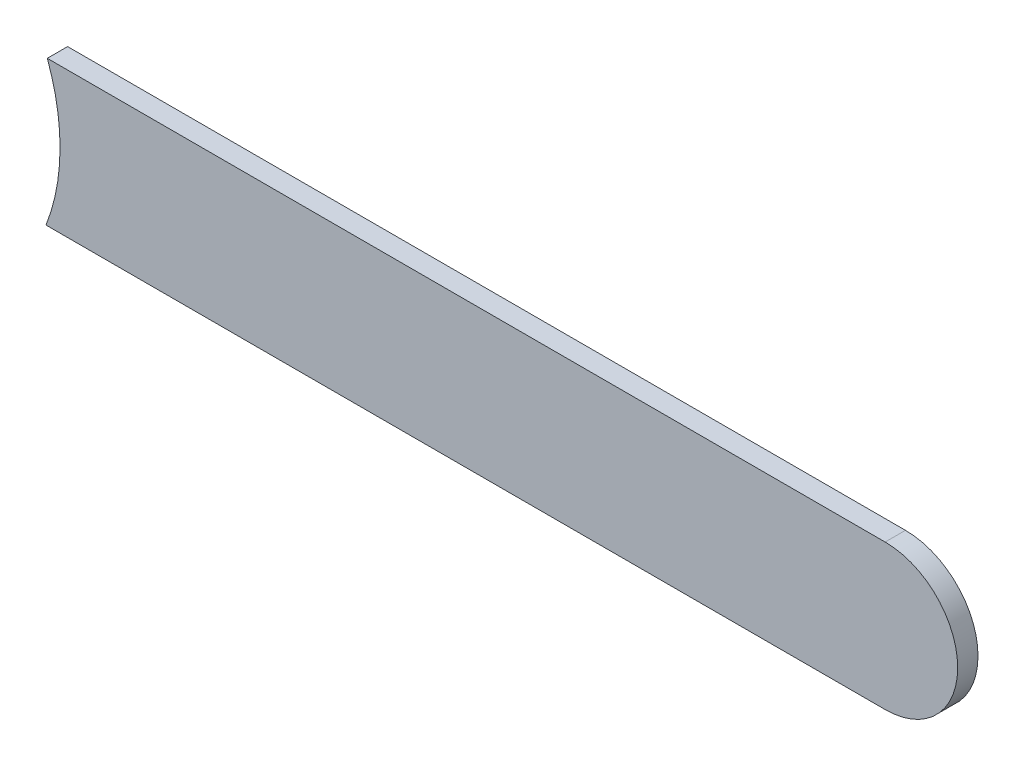
ISO-10303-21;
HEADER;
FILE_DESCRIPTION(('STEP AP214'),'2;1');
FILE_NAME('part.step','',(''),(''),'','','');
FILE_SCHEMA(('AUTOMOTIVE_DESIGN { 1 0 10303 214 1 1 1 1 }'));
ENDSEC;
DATA;
#1=APPLICATION_CONTEXT('core data for automotive mechanical design processes');
#2=APPLICATION_PROTOCOL_DEFINITION('international standard','automotive_design',2000,#1);
#3=PRODUCT_CONTEXT('',#1,'mechanical');
#4=PRODUCT('Part','Part','',(#3));
#5=PRODUCT_RELATED_PRODUCT_CATEGORY('part','',(#4));
#6=PRODUCT_DEFINITION_FORMATION('','',#4);
#7=PRODUCT_DEFINITION_CONTEXT('part definition',#1,'design');
#8=PRODUCT_DEFINITION('design','',#6,#7);
#9=PRODUCT_DEFINITION_SHAPE('','',#8);
#10=(LENGTH_UNIT() NAMED_UNIT(*) SI_UNIT(.MILLI.,.METRE.));
#11=(NAMED_UNIT(*) PLANE_ANGLE_UNIT() SI_UNIT($,.RADIAN.));
#12=(NAMED_UNIT(*) SI_UNIT($,.STERADIAN.) SOLID_ANGLE_UNIT());
#13=UNCERTAINTY_MEASURE_WITH_UNIT(LENGTH_MEASURE(1.E-05),#10,'distance_accuracy_value','');
#14=(GEOMETRIC_REPRESENTATION_CONTEXT(3) GLOBAL_UNCERTAINTY_ASSIGNED_CONTEXT((#13)) GLOBAL_UNIT_ASSIGNED_CONTEXT((#10,
#11,#12)) REPRESENTATION_CONTEXT('',''));
#15=CARTESIAN_POINT('',(0.,0.,0.));
#16=DIRECTION('',(0.,0.,1.));
#17=DIRECTION('',(1.,0.,0.));
#18=AXIS2_PLACEMENT_3D('',#15,#16,#17);
#19=CARTESIAN_POINT('',(85.8479784906732,102.157022,0.));
#20=DIRECTION('',(0.,1.,0.));
#21=DIRECTION('',(1.,0.,0.));
#22=AXIS2_PLACEMENT_3D('',#19,#20,#21);
#23=PLANE('',#22);
#24=DIRECTION('',(1.,0.,0.));
#25=VECTOR('',#24,1.);
#26=CARTESIAN_POINT('',(85.51992548,102.157022,0.03556));
#27=LINE('',#26,#25);
#28=CARTESIAN_POINT('',(85.8479784906732,102.157022,0.03556));
#29=VERTEX_POINT('',#28);
#30=CARTESIAN_POINT('',(87.3170212,102.157022,0.03556));
#31=VERTEX_POINT('',#30);
#32=EDGE_CURVE('E11',#29,#31,#27,.T.);
#33=ORIENTED_EDGE('',*,*,#32,.F.);
#34=DIRECTION('',(0.,0.,1.));
#35=VECTOR('',#34,1.);
#36=CARTESIAN_POINT('',(85.8479784906732,102.157022,0.));
#37=LINE('',#36,#35);
#38=CARTESIAN_POINT('',(85.8479784906732,102.157022,0.));
#39=VERTEX_POINT('',#38);
#40=EDGE_CURVE('E24',#39,#29,#37,.T.);
#41=ORIENTED_EDGE('',*,*,#40,.F.);
#42=DIRECTION('',(1.,0.,0.));
#43=VECTOR('',#42,1.);
#44=CARTESIAN_POINT('',(85.51992548,102.157022,0.));
#45=LINE('',#44,#43);
#46=CARTESIAN_POINT('',(87.3170212,102.157022,0.));
#47=VERTEX_POINT('',#46);
#48=EDGE_CURVE('E82',#39,#47,#45,.T.);
#49=ORIENTED_EDGE('',*,*,#48,.T.);
#50=DIRECTION('',(0.,0.,1.));
#51=VECTOR('',#50,1.);
#52=CARTESIAN_POINT('',(87.3170212,102.157022,0.));
#53=LINE('',#52,#51);
#54=EDGE_CURVE('E37',#47,#31,#53,.T.);
#55=ORIENTED_EDGE('',*,*,#54,.T.);
#56=EDGE_LOOP('',(#33,#41,#49,#55));
#57=FACE_BOUND('',#56,.T.);
#58=ADVANCED_FACE('F17',(#57),#23,.F.);
#59=CARTESIAN_POINT('',(87.3170212,102.284022,0.));
#60=DIRECTION('',(0.,0.,-1.));
#61=DIRECTION('',(0.,-1.,0.));
#62=AXIS2_PLACEMENT_3D('',#59,#60,#61);
#63=CYLINDRICAL_SURFACE('',#62,0.127);
#64=CARTESIAN_POINT('',(87.3170212,102.284022,0.03556));
#65=DIRECTION('',(0.,0.,1.));
#66=DIRECTION('',(0.,-1.,0.));
#67=AXIS2_PLACEMENT_3D('',#64,#65,#66);
#68=CIRCLE('',#67,0.127);
#69=CARTESIAN_POINT('',(87.3170212,102.411022,0.03556));
#70=VERTEX_POINT('',#69);
#71=EDGE_CURVE('E97',#31,#70,#68,.T.);
#72=ORIENTED_EDGE('',*,*,#71,.F.);
#73=ORIENTED_EDGE('',*,*,#54,.F.);
#74=CARTESIAN_POINT('',(87.3170212,102.284022,0.));
#75=DIRECTION('',(0.,0.,1.));
#76=DIRECTION('',(0.,-1.,0.));
#77=AXIS2_PLACEMENT_3D('',#74,#75,#76);
#78=CIRCLE('',#77,0.127);
#79=CARTESIAN_POINT('',(87.3170212,102.411022,0.));
#80=VERTEX_POINT('',#79);
#81=EDGE_CURVE('E94',#47,#80,#78,.T.);
#82=ORIENTED_EDGE('',*,*,#81,.T.);
#83=DIRECTION('',(0.,0.,1.));
#84=VECTOR('',#83,1.);
#85=CARTESIAN_POINT('',(87.3170212,102.411022,0.));
#86=LINE('',#85,#84);
#87=EDGE_CURVE('E92',#80,#70,#86,.T.);
#88=ORIENTED_EDGE('',*,*,#87,.T.);
#89=EDGE_LOOP('',(#72,#73,#82,#88));
#90=FACE_BOUND('',#89,.T.);
#91=ADVANCED_FACE('F103',(#90),#63,.T.);
#92=CARTESIAN_POINT('',(87.3170212,102.411022,0.));
#93=DIRECTION('',(0.,-1.,0.));
#94=DIRECTION('',(-1.,0.,0.));
#95=AXIS2_PLACEMENT_3D('',#92,#93,#94);
#96=PLANE('',#95);
#97=DIRECTION('',(-1.,0.,0.));
#98=VECTOR('',#97,1.);
#99=CARTESIAN_POINT('',(87.3170212,102.411022,0.03556));
#100=LINE('',#99,#98);
#101=CARTESIAN_POINT('',(85.8502356459868,102.411022,0.03556));
#102=VERTEX_POINT('',#101);
#103=EDGE_CURVE('E89',#70,#102,#100,.T.);
#104=ORIENTED_EDGE('',*,*,#103,.F.);
#105=ORIENTED_EDGE('',*,*,#87,.F.);
#106=DIRECTION('',(-1.,0.,0.));
#107=VECTOR('',#106,1.);
#108=CARTESIAN_POINT('',(87.3170212,102.411022,0.));
#109=LINE('',#108,#107);
#110=CARTESIAN_POINT('',(85.8502356459868,102.411022,0.));
#111=VERTEX_POINT('',#110);
#112=EDGE_CURVE('E87',#80,#111,#109,.T.);
#113=ORIENTED_EDGE('',*,*,#112,.T.);
#114=DIRECTION('',(0.,0.,1.));
#115=VECTOR('',#114,1.);
#116=CARTESIAN_POINT('',(85.8502356459868,102.411022,0.));
#117=LINE('',#116,#115);
#118=EDGE_CURVE('E69',#111,#102,#117,.T.);
#119=ORIENTED_EDGE('',*,*,#118,.T.);
#120=EDGE_LOOP('',(#104,#105,#113,#119));
#121=FACE_BOUND('',#120,.T.);
#122=ADVANCED_FACE('F108',(#121),#96,.F.);
#123=CARTESIAN_POINT('',(85.516974,102.28697348,0.));
#124=DIRECTION('',(0.,0.,-1.));
#125=DIRECTION('',(1.,0.,0.));
#126=AXIS2_PLACEMENT_3D('',#123,#124,#125);
#127=CYLINDRICAL_SURFACE('',#126,0.3556);
#128=DIRECTION('',(0.,0.,1.));
#129=VECTOR('',#128,1.);
#130=CARTESIAN_POINT('',(85.872574,102.28697348,0.));
#131=LINE('',#130,#129);
#132=CARTESIAN_POINT('',(85.872574,102.28697348,0.));
#133=VERTEX_POINT('',#132);
#134=CARTESIAN_POINT('',(85.872574,102.28697348,0.03556));
#135=VERTEX_POINT('',#134);
#136=EDGE_CURVE('E59',#133,#135,#131,.T.);
#137=ORIENTED_EDGE('',*,*,#136,.T.);
#138=CARTESIAN_POINT('',(85.516974,102.28697348,0.03556));
#139=DIRECTION('',(0.,0.,1.));
#140=DIRECTION('',(1.,0.,0.));
#141=AXIS2_PLACEMENT_3D('',#138,#139,#140);
#142=CIRCLE('',#141,0.3556);
#143=EDGE_CURVE('E70',#135,#102,#142,.T.);
#144=ORIENTED_EDGE('',*,*,#143,.T.);
#145=ORIENTED_EDGE('',*,*,#118,.F.);
#146=CARTESIAN_POINT('',(85.516974,102.28697348,0.));
#147=DIRECTION('',(0.,0.,1.));
#148=DIRECTION('',(1.,0.,0.));
#149=AXIS2_PLACEMENT_3D('',#146,#147,#148);
#150=CIRCLE('',#149,0.3556);
#151=EDGE_CURVE('E73',#133,#111,#150,.T.);
#152=ORIENTED_EDGE('',*,*,#151,.F.);
#153=EDGE_LOOP('',(#137,#144,#145,#152));
#154=FACE_BOUND('',#153,.T.);
#155=ADVANCED_FACE('F74',(#154),#127,.F.);
#156=CARTESIAN_POINT('',(85.516974,102.28697348,0.));
#157=DIRECTION('',(0.,0.,-1.));
#158=DIRECTION('',(1.,0.,0.));
#159=AXIS2_PLACEMENT_3D('',#156,#157,#158);
#160=CYLINDRICAL_SURFACE('',#159,0.3556);
#161=ORIENTED_EDGE('',*,*,#40,.T.);
#162=CARTESIAN_POINT('',(85.516974,102.28697348,0.03556));
#163=DIRECTION('',(0.,0.,1.));
#164=DIRECTION('',(1.,0.,0.));
#165=AXIS2_PLACEMENT_3D('',#162,#163,#164);
#166=CIRCLE('',#165,0.3556);
#167=EDGE_CURVE('E65',#29,#135,#166,.T.);
#168=ORIENTED_EDGE('',*,*,#167,.T.);
#169=ORIENTED_EDGE('',*,*,#136,.F.);
#170=EDGE_CURVE('E63',#39,#133,#150,.T.);
#171=ORIENTED_EDGE('',*,*,#170,.F.);
#172=EDGE_LOOP('',(#161,#168,#169,#171));
#173=FACE_BOUND('',#172,.T.);
#174=ADVANCED_FACE('F61',(#173),#160,.F.);
#175=CARTESIAN_POINT('',(85.51992548,102.157022,0.));
#176=DIRECTION('',(0.,0.,-1.));
#177=DIRECTION('',(-1.,0.,0.));
#178=AXIS2_PLACEMENT_3D('',#175,#176,#177);
#179=PLANE('',#178);
#180=ORIENTED_EDGE('',*,*,#48,.F.);
#181=ORIENTED_EDGE('',*,*,#170,.T.);
#182=ORIENTED_EDGE('',*,*,#151,.T.);
#183=ORIENTED_EDGE('',*,*,#112,.F.);
#184=ORIENTED_EDGE('',*,*,#81,.F.);
#185=EDGE_LOOP('',(#180,#181,#182,#183,#184));
#186=FACE_BOUND('',#185,.T.);
#187=ADVANCED_FACE('F80',(#186),#179,.T.);
#188=CARTESIAN_POINT('',(85.51992548,102.157022,0.03556));
#189=DIRECTION('',(0.,0.,-1.));
#190=DIRECTION('',(-1.,0.,0.));
#191=AXIS2_PLACEMENT_3D('',#188,#189,#190);
#192=PLANE('',#191);
#193=ORIENTED_EDGE('',*,*,#167,.F.);
#194=ORIENTED_EDGE('',*,*,#32,.T.);
#195=ORIENTED_EDGE('',*,*,#71,.T.);
#196=ORIENTED_EDGE('',*,*,#103,.T.);
#197=ORIENTED_EDGE('',*,*,#143,.F.);
#198=EDGE_LOOP('',(#193,#194,#195,#196,#197));
#199=FACE_BOUND('',#198,.T.);
#200=ADVANCED_FACE('F106',(#199),#192,.F.);
#201=CLOSED_SHELL('',(#58,#91,#122,#155,#174,#187,#200));
#202=MANIFOLD_SOLID_BREP('B1',#201);
#203=ADVANCED_BREP_SHAPE_REPRESENTATION('',(#18,#202),#14);
#204=SHAPE_DEFINITION_REPRESENTATION(#9,#203);
ENDSEC;
END-ISO-10303-21;
